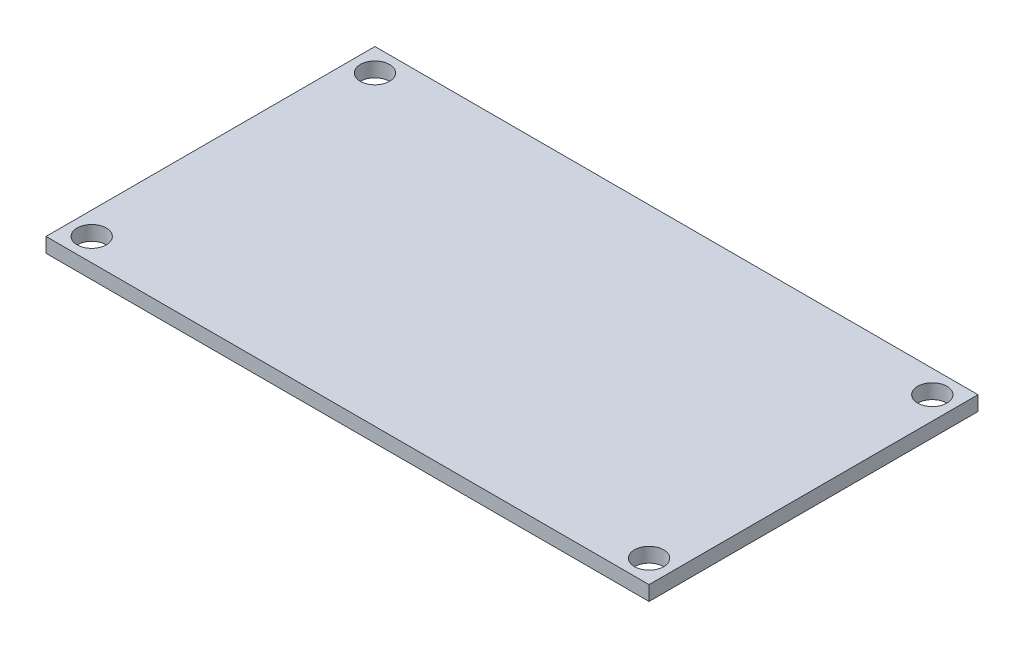
ISO-10303-21;
HEADER;
FILE_DESCRIPTION(('STEP AP214'),'2;1');
FILE_NAME('part.step','',(''),(''),'','','');
FILE_SCHEMA(('AUTOMOTIVE_DESIGN { 1 0 10303 214 1 1 1 1 }'));
ENDSEC;
DATA;
#1=APPLICATION_CONTEXT('core data for automotive mechanical design processes');
#2=APPLICATION_PROTOCOL_DEFINITION('international standard','automotive_design',2000,#1);
#3=PRODUCT_CONTEXT('',#1,'mechanical');
#4=PRODUCT('Part','Part','',(#3));
#5=PRODUCT_RELATED_PRODUCT_CATEGORY('part','',(#4));
#6=PRODUCT_DEFINITION_FORMATION('','',#4);
#7=PRODUCT_DEFINITION_CONTEXT('part definition',#1,'design');
#8=PRODUCT_DEFINITION('design','',#6,#7);
#9=PRODUCT_DEFINITION_SHAPE('','',#8);
#10=(LENGTH_UNIT() NAMED_UNIT(*) SI_UNIT(.MILLI.,.METRE.));
#11=(NAMED_UNIT(*) PLANE_ANGLE_UNIT() SI_UNIT($,.RADIAN.));
#12=(NAMED_UNIT(*) SI_UNIT($,.STERADIAN.) SOLID_ANGLE_UNIT());
#13=UNCERTAINTY_MEASURE_WITH_UNIT(LENGTH_MEASURE(1.E-05),#10,'distance_accuracy_value','');
#14=(GEOMETRIC_REPRESENTATION_CONTEXT(3) GLOBAL_UNCERTAINTY_ASSIGNED_CONTEXT((#13)) GLOBAL_UNIT_ASSIGNED_CONTEXT((#10,
#11,#12)) REPRESENTATION_CONTEXT('',''));
#15=CARTESIAN_POINT('',(0.,0.,0.));
#16=DIRECTION('',(0.,0.,1.));
#17=DIRECTION('',(1.,0.,0.));
#18=AXIS2_PLACEMENT_3D('',#15,#16,#17);
#19=CARTESIAN_POINT('',(33.,1.6,-18.));
#20=DIRECTION('',(-1.,0.,0.));
#21=DIRECTION('',(0.,0.,1.));
#22=AXIS2_PLACEMENT_3D('',#19,#20,#21);
#23=PLANE('',#22);
#24=DIRECTION('',(0.,0.,-1.));
#25=VECTOR('',#24,1.);
#26=CARTESIAN_POINT('',(33.,0.,-18.));
#27=LINE('',#26,#25);
#28=CARTESIAN_POINT('',(33.,0.,18.));
#29=VERTEX_POINT('',#28);
#30=CARTESIAN_POINT('',(33.,0.,-18.));
#31=VERTEX_POINT('',#30);
#32=EDGE_CURVE('E95',#29,#31,#27,.T.);
#33=ORIENTED_EDGE('',*,*,#32,.T.);
#34=DIRECTION('',(0.,-1.,0.));
#35=VECTOR('',#34,1.);
#36=CARTESIAN_POINT('',(33.,1.6,-18.));
#37=LINE('',#36,#35);
#38=CARTESIAN_POINT('',(33.,1.6,-18.));
#39=VERTEX_POINT('',#38);
#40=EDGE_CURVE('E11',#39,#31,#37,.T.);
#41=ORIENTED_EDGE('',*,*,#40,.F.);
#42=DIRECTION('',(0.,0.,-1.));
#43=VECTOR('',#42,1.);
#44=CARTESIAN_POINT('',(33.,1.6,-18.));
#45=LINE('',#44,#43);
#46=CARTESIAN_POINT('',(33.,1.6,18.));
#47=VERTEX_POINT('',#46);
#48=EDGE_CURVE('E83',#47,#39,#45,.T.);
#49=ORIENTED_EDGE('',*,*,#48,.F.);
#50=DIRECTION('',(0.,-1.,0.));
#51=VECTOR('',#50,1.);
#52=CARTESIAN_POINT('',(33.,1.6,18.));
#53=LINE('',#52,#51);
#54=EDGE_CURVE('E91',#47,#29,#53,.T.);
#55=ORIENTED_EDGE('',*,*,#54,.T.);
#56=EDGE_LOOP('',(#33,#41,#49,#55));
#57=FACE_BOUND('',#56,.T.);
#58=ADVANCED_FACE('F32',(#57),#23,.F.);
#59=CARTESIAN_POINT('',(-33.,1.6,-18.));
#60=DIRECTION('',(0.,0.,1.));
#61=DIRECTION('',(1.,0.,0.));
#62=AXIS2_PLACEMENT_3D('',#59,#60,#61);
#63=PLANE('',#62);
#64=DIRECTION('',(-1.,0.,0.));
#65=VECTOR('',#64,1.);
#66=CARTESIAN_POINT('',(-33.,0.,-18.));
#67=LINE('',#66,#65);
#68=CARTESIAN_POINT('',(-33.,0.,-18.));
#69=VERTEX_POINT('',#68);
#70=EDGE_CURVE('E87',#31,#69,#67,.T.);
#71=ORIENTED_EDGE('',*,*,#70,.T.);
#72=DIRECTION('',(0.,-1.,0.));
#73=VECTOR('',#72,1.);
#74=CARTESIAN_POINT('',(-33.,1.6,-18.));
#75=LINE('',#74,#73);
#76=CARTESIAN_POINT('',(-33.,1.6,-18.));
#77=VERTEX_POINT('',#76);
#78=EDGE_CURVE('E40',#77,#69,#75,.T.);
#79=ORIENTED_EDGE('',*,*,#78,.F.);
#80=DIRECTION('',(-1.,0.,0.));
#81=VECTOR('',#80,1.);
#82=CARTESIAN_POINT('',(-33.,1.6,-18.));
#83=LINE('',#82,#81);
#84=EDGE_CURVE('E78',#39,#77,#83,.T.);
#85=ORIENTED_EDGE('',*,*,#84,.F.);
#86=ORIENTED_EDGE('',*,*,#40,.T.);
#87=EDGE_LOOP('',(#71,#79,#85,#86));
#88=FACE_BOUND('',#87,.T.);
#89=ADVANCED_FACE('F86',(#88),#63,.F.);
#90=CARTESIAN_POINT('',(-33.,1.6,-18.));
#91=DIRECTION('',(1.,0.,0.));
#92=DIRECTION('',(0.,0.,-1.));
#93=AXIS2_PLACEMENT_3D('',#90,#91,#92);
#94=PLANE('',#93);
#95=DIRECTION('',(0.,0.,1.));
#96=VECTOR('',#95,1.);
#97=CARTESIAN_POINT('',(-33.,0.,-18.));
#98=LINE('',#97,#96);
#99=CARTESIAN_POINT('',(-33.,0.,18.));
#100=VERTEX_POINT('',#99);
#101=EDGE_CURVE('E65',#69,#100,#98,.T.);
#102=ORIENTED_EDGE('',*,*,#101,.T.);
#103=DIRECTION('',(0.,-1.,0.));
#104=VECTOR('',#103,1.);
#105=CARTESIAN_POINT('',(-33.,1.6,18.));
#106=LINE('',#105,#104);
#107=CARTESIAN_POINT('',(-33.,1.6,18.));
#108=VERTEX_POINT('',#107);
#109=EDGE_CURVE('E88',#108,#100,#106,.T.);
#110=ORIENTED_EDGE('',*,*,#109,.F.);
#111=DIRECTION('',(0.,0.,1.));
#112=VECTOR('',#111,1.);
#113=CARTESIAN_POINT('',(-33.,1.6,-18.));
#114=LINE('',#113,#112);
#115=EDGE_CURVE('E81',#77,#108,#114,.T.);
#116=ORIENTED_EDGE('',*,*,#115,.F.);
#117=ORIENTED_EDGE('',*,*,#78,.T.);
#118=EDGE_LOOP('',(#102,#110,#116,#117));
#119=FACE_BOUND('',#118,.T.);
#120=ADVANCED_FACE('F89',(#119),#94,.F.);
#121=CARTESIAN_POINT('',(-33.,1.6,18.));
#122=DIRECTION('',(0.,0.,-1.));
#123=DIRECTION('',(-1.,0.,0.));
#124=AXIS2_PLACEMENT_3D('',#121,#122,#123);
#125=PLANE('',#124);
#126=DIRECTION('',(1.,0.,0.));
#127=VECTOR('',#126,1.);
#128=CARTESIAN_POINT('',(-33.,0.,18.));
#129=LINE('',#128,#127);
#130=EDGE_CURVE('E71',#100,#29,#129,.T.);
#131=ORIENTED_EDGE('',*,*,#130,.T.);
#132=ORIENTED_EDGE('',*,*,#54,.F.);
#133=DIRECTION('',(1.,0.,0.));
#134=VECTOR('',#133,1.);
#135=CARTESIAN_POINT('',(-33.,1.6,18.));
#136=LINE('',#135,#134);
#137=EDGE_CURVE('E48',#108,#47,#136,.T.);
#138=ORIENTED_EDGE('',*,*,#137,.F.);
#139=ORIENTED_EDGE('',*,*,#109,.T.);
#140=EDGE_LOOP('',(#131,#132,#138,#139));
#141=FACE_BOUND('',#140,.T.);
#142=ADVANCED_FACE('F103',(#141),#125,.F.);
#143=CARTESIAN_POINT('',(0.,1.6,0.));
#144=DIRECTION('',(0.,1.,0.));
#145=DIRECTION('',(0.,0.,1.));
#146=AXIS2_PLACEMENT_3D('',#143,#144,#145);
#147=PLANE('',#146);
#148=CARTESIAN_POINT('',(30.5,1.6,15.5));
#149=DIRECTION('',(0.,1.,0.));
#150=DIRECTION('',(0.,0.,1.));
#151=AXIS2_PLACEMENT_3D('',#148,#149,#150);
#152=CIRCLE('',#151,1.6);
#153=CARTESIAN_POINT('',(30.5,1.6,17.1));
#154=VERTEX_POINT('',#153);
#155=EDGE_CURVE('E129',#154,#154,#152,.T.);
#156=ORIENTED_EDGE('',*,*,#155,.F.);
#157=EDGE_LOOP('',(#156));
#158=FACE_BOUND('',#157,.T.);
#159=CARTESIAN_POINT('',(-30.5,1.6,15.5));
#160=DIRECTION('',(0.,1.,0.));
#161=DIRECTION('',(0.,0.,1.));
#162=AXIS2_PLACEMENT_3D('',#159,#160,#161);
#163=CIRCLE('',#162,1.6);
#164=CARTESIAN_POINT('',(-30.5,1.6,17.1));
#165=VERTEX_POINT('',#164);
#166=EDGE_CURVE('E123',#165,#165,#163,.T.);
#167=ORIENTED_EDGE('',*,*,#166,.F.);
#168=EDGE_LOOP('',(#167));
#169=FACE_BOUND('',#168,.T.);
#170=CARTESIAN_POINT('',(30.5,1.6,-15.5));
#171=DIRECTION('',(0.,1.,0.));
#172=DIRECTION('',(0.,0.,1.));
#173=AXIS2_PLACEMENT_3D('',#170,#171,#172);
#174=CIRCLE('',#173,1.6);
#175=CARTESIAN_POINT('',(30.5,1.6,-13.9));
#176=VERTEX_POINT('',#175);
#177=EDGE_CURVE('E117',#176,#176,#174,.T.);
#178=ORIENTED_EDGE('',*,*,#177,.F.);
#179=EDGE_LOOP('',(#178));
#180=FACE_BOUND('',#179,.T.);
#181=CARTESIAN_POINT('',(-30.5,1.6,-15.5));
#182=DIRECTION('',(0.,1.,0.));
#183=DIRECTION('',(0.,0.,1.));
#184=AXIS2_PLACEMENT_3D('',#181,#182,#183);
#185=CIRCLE('',#184,1.6);
#186=CARTESIAN_POINT('',(-30.5,1.6,-13.9));
#187=VERTEX_POINT('',#186);
#188=EDGE_CURVE('E111',#187,#187,#185,.T.);
#189=ORIENTED_EDGE('',*,*,#188,.F.);
#190=EDGE_LOOP('',(#189));
#191=FACE_BOUND('',#190,.T.);
#192=ORIENTED_EDGE('',*,*,#48,.T.);
#193=ORIENTED_EDGE('',*,*,#84,.T.);
#194=ORIENTED_EDGE('',*,*,#115,.T.);
#195=ORIENTED_EDGE('',*,*,#137,.T.);
#196=EDGE_LOOP('',(#192,#193,#194,#195));
#197=FACE_BOUND('',#196,.T.);
#198=ADVANCED_FACE('F79',(#158,#169,#180,#191,#197),#147,.T.);
#199=CARTESIAN_POINT('',(0.,0.,0.));
#200=DIRECTION('',(0.,1.,0.));
#201=DIRECTION('',(0.,0.,1.));
#202=AXIS2_PLACEMENT_3D('',#199,#200,#201);
#203=PLANE('',#202);
#204=CARTESIAN_POINT('',(30.5,0.,15.5));
#205=DIRECTION('',(0.,1.,0.));
#206=DIRECTION('',(0.,0.,1.));
#207=AXIS2_PLACEMENT_3D('',#204,#205,#206);
#208=CIRCLE('',#207,1.6);
#209=CARTESIAN_POINT('',(30.5,0.,17.1));
#210=VERTEX_POINT('',#209);
#211=EDGE_CURVE('E126',#210,#210,#208,.T.);
#212=ORIENTED_EDGE('',*,*,#211,.T.);
#213=EDGE_LOOP('',(#212));
#214=FACE_BOUND('',#213,.T.);
#215=CARTESIAN_POINT('',(-30.5,0.,15.5));
#216=DIRECTION('',(0.,1.,0.));
#217=DIRECTION('',(0.,0.,1.));
#218=AXIS2_PLACEMENT_3D('',#215,#216,#217);
#219=CIRCLE('',#218,1.6);
#220=CARTESIAN_POINT('',(-30.5,0.,17.1));
#221=VERTEX_POINT('',#220);
#222=EDGE_CURVE('E120',#221,#221,#219,.T.);
#223=ORIENTED_EDGE('',*,*,#222,.T.);
#224=EDGE_LOOP('',(#223));
#225=FACE_BOUND('',#224,.T.);
#226=CARTESIAN_POINT('',(30.5,0.,-15.5));
#227=DIRECTION('',(0.,1.,0.));
#228=DIRECTION('',(0.,0.,1.));
#229=AXIS2_PLACEMENT_3D('',#226,#227,#228);
#230=CIRCLE('',#229,1.6);
#231=CARTESIAN_POINT('',(30.5,0.,-13.9));
#232=VERTEX_POINT('',#231);
#233=EDGE_CURVE('E114',#232,#232,#230,.T.);
#234=ORIENTED_EDGE('',*,*,#233,.T.);
#235=EDGE_LOOP('',(#234));
#236=FACE_BOUND('',#235,.T.);
#237=CARTESIAN_POINT('',(-30.5,0.,-15.5));
#238=DIRECTION('',(0.,1.,0.));
#239=DIRECTION('',(0.,0.,1.));
#240=AXIS2_PLACEMENT_3D('',#237,#238,#239);
#241=CIRCLE('',#240,1.6);
#242=CARTESIAN_POINT('',(-30.5,0.,-13.9));
#243=VERTEX_POINT('',#242);
#244=EDGE_CURVE('E98',#243,#243,#241,.T.);
#245=ORIENTED_EDGE('',*,*,#244,.T.);
#246=EDGE_LOOP('',(#245));
#247=FACE_BOUND('',#246,.T.);
#248=ORIENTED_EDGE('',*,*,#32,.F.);
#249=ORIENTED_EDGE('',*,*,#130,.F.);
#250=ORIENTED_EDGE('',*,*,#101,.F.);
#251=ORIENTED_EDGE('',*,*,#70,.F.);
#252=EDGE_LOOP('',(#248,#249,#250,#251));
#253=FACE_BOUND('',#252,.T.);
#254=ADVANCED_FACE('F106',(#214,#225,#236,#247,#253),#203,.F.);
#255=CARTESIAN_POINT('',(-30.5,1.6,-15.5));
#256=DIRECTION('',(0.,1.,0.));
#257=DIRECTION('',(0.,0.,1.));
#258=AXIS2_PLACEMENT_3D('',#255,#256,#257);
#259=CYLINDRICAL_SURFACE('',#258,1.6);
#260=ORIENTED_EDGE('',*,*,#244,.F.);
#261=EDGE_LOOP('',(#260));
#262=FACE_BOUND('',#261,.T.);
#263=ORIENTED_EDGE('',*,*,#188,.T.);
#264=EDGE_LOOP('',(#263));
#265=FACE_BOUND('',#264,.T.);
#266=ADVANCED_FACE('F144',(#262,#265),#259,.F.);
#267=CARTESIAN_POINT('',(30.5,1.6,-15.5));
#268=DIRECTION('',(0.,1.,0.));
#269=DIRECTION('',(0.,0.,1.));
#270=AXIS2_PLACEMENT_3D('',#267,#268,#269);
#271=CYLINDRICAL_SURFACE('',#270,1.6);
#272=ORIENTED_EDGE('',*,*,#233,.F.);
#273=EDGE_LOOP('',(#272));
#274=FACE_BOUND('',#273,.T.);
#275=ORIENTED_EDGE('',*,*,#177,.T.);
#276=EDGE_LOOP('',(#275));
#277=FACE_BOUND('',#276,.T.);
#278=ADVANCED_FACE('F146',(#274,#277),#271,.F.);
#279=CARTESIAN_POINT('',(-30.5,1.6,15.5));
#280=DIRECTION('',(0.,1.,0.));
#281=DIRECTION('',(0.,0.,1.));
#282=AXIS2_PLACEMENT_3D('',#279,#280,#281);
#283=CYLINDRICAL_SURFACE('',#282,1.6);
#284=ORIENTED_EDGE('',*,*,#222,.F.);
#285=EDGE_LOOP('',(#284));
#286=FACE_BOUND('',#285,.T.);
#287=ORIENTED_EDGE('',*,*,#166,.T.);
#288=EDGE_LOOP('',(#287));
#289=FACE_BOUND('',#288,.T.);
#290=ADVANCED_FACE('F153',(#286,#289),#283,.F.);
#291=CARTESIAN_POINT('',(30.5,1.6,15.5));
#292=DIRECTION('',(0.,1.,0.));
#293=DIRECTION('',(0.,0.,1.));
#294=AXIS2_PLACEMENT_3D('',#291,#292,#293);
#295=CYLINDRICAL_SURFACE('',#294,1.6);
#296=ORIENTED_EDGE('',*,*,#211,.F.);
#297=EDGE_LOOP('',(#296));
#298=FACE_BOUND('',#297,.T.);
#299=ORIENTED_EDGE('',*,*,#155,.T.);
#300=EDGE_LOOP('',(#299));
#301=FACE_BOUND('',#300,.T.);
#302=ADVANCED_FACE('F133',(#298,#301),#295,.F.);
#303=CLOSED_SHELL('',(#58,#89,#120,#142,#198,#254,#266,#278,#290,#302));
#304=MANIFOLD_SOLID_BREP('B2',#303);
#305=ADVANCED_BREP_SHAPE_REPRESENTATION('',(#18,#304),#14);
#306=SHAPE_DEFINITION_REPRESENTATION(#9,#305);
ENDSEC;
END-ISO-10303-21;
